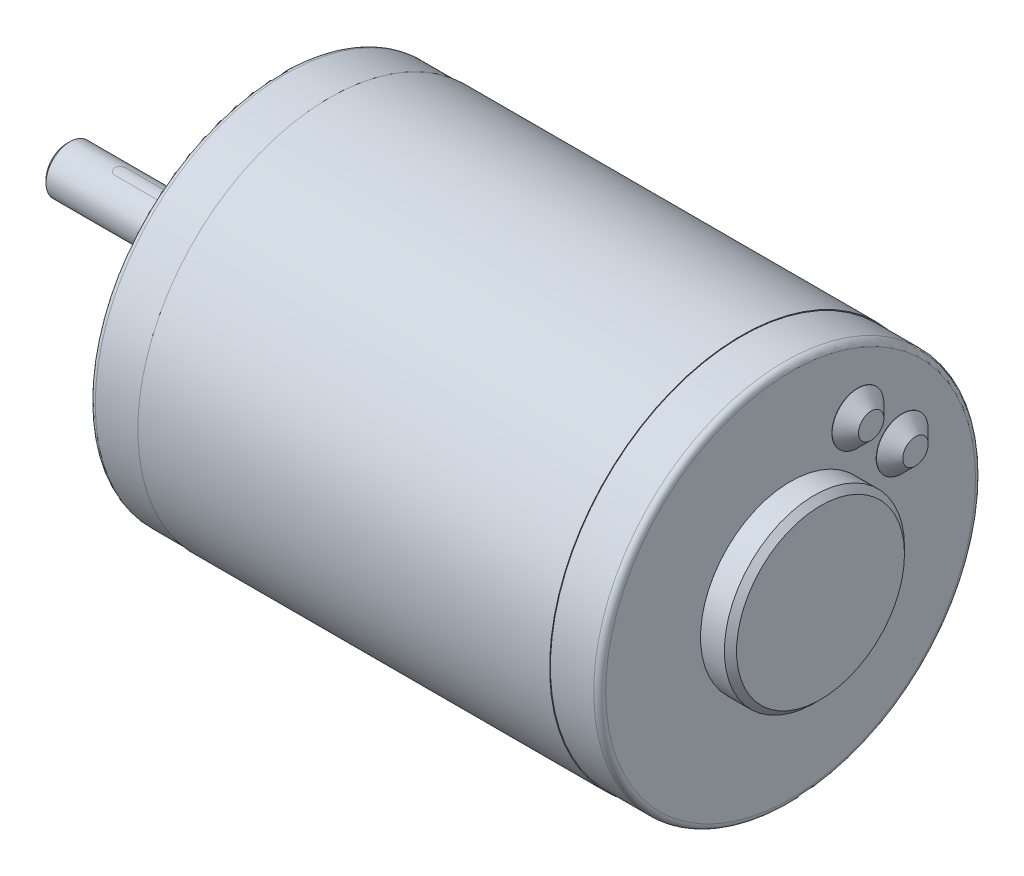
ISO-10303-21;
HEADER;
FILE_DESCRIPTION(('STEP AP214'),'2;1');
FILE_NAME('part.step','',(''),(''),'','','');
FILE_SCHEMA(('AUTOMOTIVE_DESIGN { 1 0 10303 214 1 1 1 1 }'));
ENDSEC;
DATA;
#1=APPLICATION_CONTEXT('core data for automotive mechanical design processes');
#2=APPLICATION_PROTOCOL_DEFINITION('international standard','automotive_design',2000,#1);
#3=PRODUCT_CONTEXT('',#1,'mechanical');
#4=PRODUCT('Part','Part','',(#3));
#5=PRODUCT_RELATED_PRODUCT_CATEGORY('part','',(#4));
#6=PRODUCT_DEFINITION_FORMATION('','',#4);
#7=PRODUCT_DEFINITION_CONTEXT('part definition',#1,'design');
#8=PRODUCT_DEFINITION('design','',#6,#7);
#9=PRODUCT_DEFINITION_SHAPE('','',#8);
#10=(LENGTH_UNIT() NAMED_UNIT(*) SI_UNIT(.MILLI.,.METRE.));
#11=(NAMED_UNIT(*) PLANE_ANGLE_UNIT() SI_UNIT($,.RADIAN.));
#12=(NAMED_UNIT(*) SI_UNIT($,.STERADIAN.) SOLID_ANGLE_UNIT());
#13=UNCERTAINTY_MEASURE_WITH_UNIT(LENGTH_MEASURE(1.E-05),#10,'distance_accuracy_value','');
#14=(GEOMETRIC_REPRESENTATION_CONTEXT(3) GLOBAL_UNCERTAINTY_ASSIGNED_CONTEXT((#13)) GLOBAL_UNIT_ASSIGNED_CONTEXT((#10,
#11,#12)) REPRESENTATION_CONTEXT('',''));
#15=CARTESIAN_POINT('',(0.,0.,0.));
#16=DIRECTION('',(0.,0.,1.));
#17=DIRECTION('',(1.,0.,0.));
#18=AXIS2_PLACEMENT_3D('',#15,#16,#17);
#19=CARTESIAN_POINT('',(-4.,0.,0.));
#20=DIRECTION('',(-1.,0.,0.));
#21=DIRECTION('',(0.,0.,1.));
#22=AXIS2_PLACEMENT_3D('',#19,#20,#21);
#23=PLANE('',#22);
#24=CARTESIAN_POINT('',(-4.,0.,0.));
#25=DIRECTION('',(-1.,0.,0.));
#26=DIRECTION('',(0.,0.,1.));
#27=AXIS2_PLACEMENT_3D('',#24,#25,#26);
#28=CIRCLE('',#27,8.50900000000003);
#29=CARTESIAN_POINT('',(-4.,0.,8.50900000000003));
#30=VERTEX_POINT('',#29);
#31=EDGE_CURVE('P0_E187',#30,#30,#28,.T.);
#32=ORIENTED_EDGE('',*,*,#31,.T.);
#33=EDGE_LOOP('',(#32));
#34=FACE_BOUND('',#33,.T.);
#35=CARTESIAN_POINT('',(-4.,0.,0.));
#36=DIRECTION('',(-1.,0.,0.));
#37=DIRECTION('',(0.,0.,1.));
#38=AXIS2_PLACEMENT_3D('',#35,#36,#37);
#39=CIRCLE('',#38,4.);
#40=CARTESIAN_POINT('',(-4.,0.,4.));
#41=VERTEX_POINT('',#40);
#42=EDGE_CURVE('P0_E119',#41,#41,#39,.T.);
#43=ORIENTED_EDGE('',*,*,#42,.F.);
#44=EDGE_LOOP('',(#43));
#45=FACE_BOUND('',#44,.T.);
#46=ADVANCED_FACE('P0_F36',(#34,#45),#23,.T.);
#47=CARTESIAN_POINT('',(0.,0.,0.));
#48=DIRECTION('',(-1.,0.,0.));
#49=DIRECTION('',(0.,0.,1.));
#50=AXIS2_PLACEMENT_3D('',#47,#48,#49);
#51=PLANE('',#50);
#52=CARTESIAN_POINT('',(0.,0.,0.));
#53=DIRECTION('',(-1.,0.,0.));
#54=DIRECTION('',(0.,0.,1.));
#55=AXIS2_PLACEMENT_3D('',#52,#53,#54);
#56=CIRCLE('',#55,30.877);
#57=CARTESIAN_POINT('',(0.,0.,30.877));
#58=VERTEX_POINT('',#57);
#59=EDGE_CURVE('P0_E205',#58,#58,#56,.T.);
#60=ORIENTED_EDGE('',*,*,#59,.T.);
#61=EDGE_LOOP('',(#60));
#62=FACE_BOUND('',#61,.T.);
#63=CARTESIAN_POINT('',(0.,25.4,0.));
#64=DIRECTION('',(-1.,0.,0.));
#65=DIRECTION('',(0.,0.,1.));
#66=AXIS2_PLACEMENT_3D('',#63,#64,#65);
#67=CIRCLE('',#66,2.01929999999999);
#68=CARTESIAN_POINT('',(0.,25.4,2.01929999999999));
#69=VERTEX_POINT('',#68);
#70=EDGE_CURVE('P0_E93',#69,#69,#67,.T.);
#71=ORIENTED_EDGE('',*,*,#70,.F.);
#72=EDGE_LOOP('',(#71));
#73=FACE_BOUND('',#72,.T.);
#74=CARTESIAN_POINT('',(0.,-25.4,0.));
#75=DIRECTION('',(-1.,0.,0.));
#76=DIRECTION('',(0.,0.,1.));
#77=AXIS2_PLACEMENT_3D('',#74,#75,#76);
#78=CIRCLE('',#77,2.01929999999999);
#79=CARTESIAN_POINT('',(0.,-25.4,2.01929999999999));
#80=VERTEX_POINT('',#79);
#81=EDGE_CURVE('P0_E92',#80,#80,#78,.T.);
#82=ORIENTED_EDGE('',*,*,#81,.F.);
#83=EDGE_LOOP('',(#82));
#84=FACE_BOUND('',#83,.T.);
#85=CARTESIAN_POINT('',(0.,0.,0.));
#86=DIRECTION('',(-1.,0.,0.));
#87=DIRECTION('',(0.,0.,1.));
#88=AXIS2_PLACEMENT_3D('',#85,#86,#87);
#89=CIRCLE('',#88,9.525);
#90=CARTESIAN_POINT('',(0.,0.,9.525));
#91=VERTEX_POINT('',#90);
#92=EDGE_CURVE('P0_E163',#91,#91,#89,.T.);
#93=ORIENTED_EDGE('',*,*,#92,.F.);
#94=EDGE_LOOP('',(#93));
#95=FACE_BOUND('',#94,.T.);
#96=ADVANCED_FACE('P0_F226',(#62,#73,#84,#95),#51,.T.);
#97=CARTESIAN_POINT('',(8.2296,32.004,0.));
#98=DIRECTION('',(-1.,0.,0.));
#99=DIRECTION('',(0.,0.,1.));
#100=AXIS2_PLACEMENT_3D('',#97,#98,#99);
#101=PLANE('',#100);
#102=CARTESIAN_POINT('',(8.2296,0.,0.));
#103=DIRECTION('',(1.,0.,0.));
#104=DIRECTION('',(0.,0.,-1.));
#105=AXIS2_PLACEMENT_3D('',#102,#103,#104);
#106=CIRCLE('',#105,32.004);
#107=CARTESIAN_POINT('',(8.2296,0.,-32.004));
#108=VERTEX_POINT('',#107);
#109=EDGE_CURVE('P0_E178',#108,#108,#106,.T.);
#110=ORIENTED_EDGE('',*,*,#109,.F.);
#111=EDGE_LOOP('',(#110));
#112=FACE_BOUND('',#111,.T.);
#113=CARTESIAN_POINT('',(8.2296,0.,0.));
#114=DIRECTION('',(-1.,0.,0.));
#115=DIRECTION('',(0.,0.,1.));
#116=AXIS2_PLACEMENT_3D('',#113,#114,#115);
#117=CIRCLE('',#116,31.877);
#118=CARTESIAN_POINT('',(8.2296,0.,31.877));
#119=VERTEX_POINT('',#118);
#120=EDGE_CURVE('P0_E166',#119,#119,#117,.T.);
#121=ORIENTED_EDGE('',*,*,#120,.F.);
#122=EDGE_LOOP('',(#121));
#123=FACE_BOUND('',#122,.T.);
#124=ADVANCED_FACE('P0_F232',(#112,#123),#101,.T.);
#125=CARTESIAN_POINT('',(85.216,0.,0.));
#126=DIRECTION('',(1.,0.,0.));
#127=DIRECTION('',(0.,0.,-1.));
#128=AXIS2_PLACEMENT_3D('',#125,#126,#127);
#129=PLANE('',#128);
#130=CARTESIAN_POINT('',(85.216,0.,0.));
#131=DIRECTION('',(1.,0.,0.));
#132=DIRECTION('',(0.,0.,-1.));
#133=AXIS2_PLACEMENT_3D('',#130,#131,#132);
#134=CIRCLE('',#133,30.877);
#135=CARTESIAN_POINT('',(85.216,0.,-30.877));
#136=VERTEX_POINT('',#135);
#137=EDGE_CURVE('P0_E44',#136,#136,#134,.T.);
#138=ORIENTED_EDGE('',*,*,#137,.T.);
#139=EDGE_LOOP('',(#138));
#140=FACE_BOUND('',#139,.T.);
#141=CARTESIAN_POINT('',(85.216,18.6070906828553,-11.2073596390943));
#142=DIRECTION('',(1.,0.,0.));
#143=DIRECTION('',(0.,0.,-1.));
#144=AXIS2_PLACEMENT_3D('',#141,#142,#143);
#145=CIRCLE('',#144,4.318);
#146=CARTESIAN_POINT('',(85.216,18.6070906828553,-15.5253596390943));
#147=VERTEX_POINT('',#146);
#148=EDGE_CURVE('P0_E184',#147,#147,#145,.T.);
#149=ORIENTED_EDGE('',*,*,#148,.F.);
#150=EDGE_LOOP('',(#149));
#151=FACE_BOUND('',#150,.T.);
#152=CARTESIAN_POINT('',(85.216,11.2073596390943,-18.6070906828553));
#153=DIRECTION('',(1.,0.,0.));
#154=DIRECTION('',(0.,0.,-1.));
#155=AXIS2_PLACEMENT_3D('',#152,#153,#154);
#156=CIRCLE('',#155,4.318);
#157=CARTESIAN_POINT('',(85.216,11.2073596390943,-22.9250906828553));
#158=VERTEX_POINT('',#157);
#159=EDGE_CURVE('P0_E181',#158,#158,#156,.T.);
#160=ORIENTED_EDGE('',*,*,#159,.F.);
#161=EDGE_LOOP('',(#160));
#162=FACE_BOUND('',#161,.T.);
#163=CARTESIAN_POINT('',(85.216,0.,0.));
#164=DIRECTION('',(1.,0.,0.));
#165=DIRECTION('',(0.,0.,-1.));
#166=AXIS2_PLACEMENT_3D('',#163,#164,#165);
#167=CIRCLE('',#166,15.0368);
#168=CARTESIAN_POINT('',(85.216,0.,-15.0368));
#169=VERTEX_POINT('',#168);
#170=EDGE_CURVE('P0_E169',#169,#169,#167,.T.);
#171=ORIENTED_EDGE('',*,*,#170,.F.);
#172=EDGE_LOOP('',(#171));
#173=FACE_BOUND('',#172,.T.);
#174=ADVANCED_FACE('P0_F213',(#140,#151,#162,#173),#129,.T.);
#175=CARTESIAN_POINT('',(76.9864,0.,0.));
#176=DIRECTION('',(1.,0.,0.));
#177=DIRECTION('',(0.,0.,-1.));
#178=AXIS2_PLACEMENT_3D('',#175,#176,#177);
#179=PLANE('',#178);
#180=CARTESIAN_POINT('',(76.9864,0.,0.));
#181=DIRECTION('',(1.,0.,0.));
#182=DIRECTION('',(0.,0.,-1.));
#183=AXIS2_PLACEMENT_3D('',#180,#181,#182);
#184=CIRCLE('',#183,32.004);
#185=CARTESIAN_POINT('',(76.9864,0.,-32.004));
#186=VERTEX_POINT('',#185);
#187=EDGE_CURVE('P0_E175',#186,#186,#184,.T.);
#188=ORIENTED_EDGE('',*,*,#187,.T.);
#189=EDGE_LOOP('',(#188));
#190=FACE_BOUND('',#189,.T.);
#191=CARTESIAN_POINT('',(76.9864,0.,0.));
#192=DIRECTION('',(1.,0.,0.));
#193=DIRECTION('',(0.,0.,-1.));
#194=AXIS2_PLACEMENT_3D('',#191,#192,#193);
#195=CIRCLE('',#194,31.877);
#196=CARTESIAN_POINT('',(76.9864,0.,-31.877));
#197=VERTEX_POINT('',#196);
#198=EDGE_CURVE('P0_E172',#197,#197,#195,.T.);
#199=ORIENTED_EDGE('',*,*,#198,.F.);
#200=EDGE_LOOP('',(#199));
#201=FACE_BOUND('',#200,.T.);
#202=ADVANCED_FACE('P0_F259',(#190,#201),#179,.T.);
#203=CARTESIAN_POINT('',(8.2296,0.,0.));
#204=DIRECTION('',(1.,0.,0.));
#205=DIRECTION('',(0.,0.,-1.));
#206=AXIS2_PLACEMENT_3D('',#203,#204,#205);
#207=CYLINDRICAL_SURFACE('',#206,32.004);
#208=ORIENTED_EDGE('',*,*,#109,.T.);
#209=EDGE_LOOP('',(#208));
#210=FACE_BOUND('',#209,.T.);
#211=ORIENTED_EDGE('',*,*,#187,.F.);
#212=EDGE_LOOP('',(#211));
#213=FACE_BOUND('',#212,.T.);
#214=ADVANCED_FACE('P0_F262',(#210,#213),#207,.T.);
#215=CARTESIAN_POINT('',(85.216,0.,0.));
#216=DIRECTION('',(-1.,0.,0.));
#217=DIRECTION('',(0.,0.,1.));
#218=AXIS2_PLACEMENT_3D('',#215,#216,#217);
#219=CYLINDRICAL_SURFACE('',#218,31.877);
#220=CARTESIAN_POINT('',(84.216,0.,0.));
#221=DIRECTION('',(1.,0.,0.));
#222=DIRECTION('',(0.,0.,-1.));
#223=AXIS2_PLACEMENT_3D('',#220,#221,#222);
#224=CIRCLE('',#223,31.877);
#225=CARTESIAN_POINT('',(84.216,0.,-31.877));
#226=VERTEX_POINT('',#225);
#227=EDGE_CURVE('P0_E11',#226,#226,#224,.F.);
#228=ORIENTED_EDGE('',*,*,#227,.T.);
#229=EDGE_LOOP('',(#228));
#230=FACE_BOUND('',#229,.T.);
#231=ORIENTED_EDGE('',*,*,#198,.T.);
#232=EDGE_LOOP('',(#231));
#233=FACE_BOUND('',#232,.T.);
#234=ADVANCED_FACE('P0_F255',(#230,#233),#219,.T.);
#235=CARTESIAN_POINT('',(90.216,0.,0.));
#236=DIRECTION('',(-1.,0.,0.));
#237=DIRECTION('',(0.,0.,1.));
#238=AXIS2_PLACEMENT_3D('',#235,#236,#237);
#239=CYLINDRICAL_SURFACE('',#238,15.0368);
#240=CARTESIAN_POINT('',(89.2,0.,0.));
#241=DIRECTION('',(1.,0.,0.));
#242=DIRECTION('',(0.,0.,-1.));
#243=AXIS2_PLACEMENT_3D('',#240,#241,#242);
#244=CIRCLE('',#243,15.0368);
#245=CARTESIAN_POINT('',(89.2,0.,-15.0368));
#246=VERTEX_POINT('',#245);
#247=EDGE_CURVE('P0_E196',#246,#246,#244,.F.);
#248=ORIENTED_EDGE('',*,*,#247,.T.);
#249=EDGE_LOOP('',(#248));
#250=FACE_BOUND('',#249,.T.);
#251=ORIENTED_EDGE('',*,*,#170,.T.);
#252=EDGE_LOOP('',(#251));
#253=FACE_BOUND('',#252,.T.);
#254=ADVANCED_FACE('P0_F251',(#250,#253),#239,.T.);
#255=CARTESIAN_POINT('',(90.216,0.,0.));
#256=DIRECTION('',(1.,0.,0.));
#257=DIRECTION('',(0.,0.,-1.));
#258=AXIS2_PLACEMENT_3D('',#255,#256,#257);
#259=PLANE('',#258);
#260=CARTESIAN_POINT('',(90.216,0.,0.));
#261=DIRECTION('',(1.,0.,0.));
#262=DIRECTION('',(0.,0.,-1.));
#263=AXIS2_PLACEMENT_3D('',#260,#261,#262);
#264=CIRCLE('',#263,14.0208);
#265=CARTESIAN_POINT('',(90.216,0.,-14.0208));
#266=VERTEX_POINT('',#265);
#267=EDGE_CURVE('P0_E193',#266,#266,#264,.T.);
#268=ORIENTED_EDGE('',*,*,#267,.T.);
#269=EDGE_LOOP('',(#268));
#270=FACE_BOUND('',#269,.T.);
#271=ADVANCED_FACE('P0_F247',(#270),#259,.T.);
#272=CARTESIAN_POINT('',(0.,0.,0.));
#273=DIRECTION('',(1.,0.,0.));
#274=DIRECTION('',(0.,0.,-1.));
#275=AXIS2_PLACEMENT_3D('',#272,#273,#274);
#276=CYLINDRICAL_SURFACE('',#275,31.877);
#277=CARTESIAN_POINT('',(0.999999999999997,0.,0.));
#278=DIRECTION('',(-1.,0.,0.));
#279=DIRECTION('',(0.,0.,1.));
#280=AXIS2_PLACEMENT_3D('',#277,#278,#279);
#281=CIRCLE('',#280,31.877);
#282=CARTESIAN_POINT('',(0.999999999999997,0.,31.877));
#283=VERTEX_POINT('',#282);
#284=EDGE_CURVE('P0_E208',#283,#283,#281,.F.);
#285=ORIENTED_EDGE('',*,*,#284,.T.);
#286=EDGE_LOOP('',(#285));
#287=FACE_BOUND('',#286,.T.);
#288=ORIENTED_EDGE('',*,*,#120,.T.);
#289=EDGE_LOOP('',(#288));
#290=FACE_BOUND('',#289,.T.);
#291=ADVANCED_FACE('P0_F242',(#287,#290),#276,.T.);
#292=CARTESIAN_POINT('',(-4.,0.,0.));
#293=DIRECTION('',(1.,0.,0.));
#294=DIRECTION('',(0.,0.,-1.));
#295=AXIS2_PLACEMENT_3D('',#292,#293,#294);
#296=CYLINDRICAL_SURFACE('',#295,9.525);
#297=CARTESIAN_POINT('',(-2.98400000000003,0.,0.));
#298=DIRECTION('',(-1.,0.,0.));
#299=DIRECTION('',(0.,0.,1.));
#300=AXIS2_PLACEMENT_3D('',#297,#298,#299);
#301=CIRCLE('',#300,9.525);
#302=CARTESIAN_POINT('',(-2.98400000000003,0.,9.525));
#303=VERTEX_POINT('',#302);
#304=EDGE_CURVE('P0_E190',#303,#303,#301,.F.);
#305=ORIENTED_EDGE('',*,*,#304,.T.);
#306=EDGE_LOOP('',(#305));
#307=FACE_BOUND('',#306,.T.);
#308=ORIENTED_EDGE('',*,*,#92,.T.);
#309=EDGE_LOOP('',(#308));
#310=FACE_BOUND('',#309,.T.);
#311=ADVANCED_FACE('P0_F240',(#307,#310),#296,.T.);
#312=CARTESIAN_POINT('',(-35.6,0.,0.));
#313=DIRECTION('',(1.,0.,0.));
#314=DIRECTION('',(0.,0.,-1.));
#315=AXIS2_PLACEMENT_3D('',#312,#313,#314);
#316=CYLINDRICAL_SURFACE('',#315,4.);
#317=CARTESIAN_POINT('',(-35.099999999993,0.,0.));
#318=DIRECTION('',(-1.,0.,0.));
#319=DIRECTION('',(0.,0.,1.));
#320=AXIS2_PLACEMENT_3D('',#317,#318,#319);
#321=CIRCLE('',#320,4.);
#322=CARTESIAN_POINT('',(-35.099999999993,0.,4.));
#323=VERTEX_POINT('',#322);
#324=EDGE_CURVE('P0_E202',#323,#323,#321,.F.);
#325=ORIENTED_EDGE('',*,*,#324,.T.);
#326=EDGE_LOOP('',(#325));
#327=FACE_BOUND('',#326,.T.);
#328=DIRECTION('',(1.,0.,0.));
#329=VECTOR('',#328,1.);
#330=CARTESIAN_POINT('',(0.,3.87298334620741,-1.));
#331=LINE('',#330,#329);
#332=CARTESIAN_POINT('',(-26.6,3.87298334620741,-1.));
#333=VERTEX_POINT('',#332);
#334=CARTESIAN_POINT('',(-7.1,3.87298334620741,-1.));
#335=VERTEX_POINT('',#334);
#336=EDGE_CURVE('P0_E138',#333,#335,#331,.T.);
#337=ORIENTED_EDGE('',*,*,#336,.T.);
#338=CARTESIAN_POINT('',(-7.1,3.87298334620741,-1.));
#339=CARTESIAN_POINT('',(-7.07233701489346,3.87298148580177,-1.00000033749611));
#340=CARTESIAN_POINT('',(-7.04468773698177,3.8732800994947,-0.998851407375366));
#341=CARTESIAN_POINT('',(-6.98959596469644,3.87445904774558,-0.994271295395754));
#342=CARTESIAN_POINT('',(-6.96215343631291,3.87533928441687,-0.990840497572679));
#343=CARTESIAN_POINT('',(-6.88054682679116,3.87881710972053,-0.977175239382526));
#344=CARTESIAN_POINT('',(-6.82694353151779,3.88225203148808,-0.963567695172493));
#345=CARTESIAN_POINT('',(-6.72287532621804,3.89095422588002,-0.927798076247997));
#346=CARTESIAN_POINT('',(-6.67241012178714,3.89622132630929,-0.905636805423836));
#347=CARTESIAN_POINT('',(-6.57588855135267,3.90799134471939,-0.853415378025865));
#348=CARTESIAN_POINT('',(-6.52983337210904,3.91449459395647,-0.823353103356933));
#349=CARTESIAN_POINT('',(-6.4424561180939,3.92816262398025,-0.755484471828069));
#350=CARTESIAN_POINT('',(-6.40124511375448,3.93533791028915,-0.717537268783976));
#351=CARTESIAN_POINT('',(-6.32569791051729,3.94945104396193,-0.63527578051623));
#352=CARTESIAN_POINT('',(-6.29136281053206,3.95638885322537,-0.590960479478831));
#353=CARTESIAN_POINT('',(-6.23008899838136,3.96936182283248,-0.496456899401691));
#354=CARTESIAN_POINT('',(-6.20326010401603,3.9753830468173,-0.446195340334474));
#355=CARTESIAN_POINT('',(-6.1584752658033,3.98572346250588,-0.341702590842919));
#356=CARTESIAN_POINT('',(-6.14051757570017,3.990042989147,-0.28747218408301));
#357=CARTESIAN_POINT('',(-6.11434100722257,3.99641900005128,-0.17774410852516));
#358=CARTESIAN_POINT('',(-6.10593232757718,3.998519529013,-0.122294322002858));
#359=CARTESIAN_POINT('',(-6.09849662845671,4.00037438150815,-0.0107327756816796));
#360=CARTESIAN_POINT('',(-6.09946842980766,4.00012899993444,0.0453789000287057));
#361=CARTESIAN_POINT('',(-6.11062996368545,3.99735237365735,0.155352492972096));
#362=CARTESIAN_POINT('',(-6.12061461659948,3.9948719867736,0.209236701739855));
#363=CARTESIAN_POINT('',(-6.14918867918275,3.98796330636495,0.31453871108434));
#364=CARTESIAN_POINT('',(-6.16777846956858,3.98353492665556,0.365956402423988));
#365=CARTESIAN_POINT('',(-6.21320128067065,3.97314997761798,0.465407286024539));
#366=CARTESIAN_POINT('',(-6.24010739423284,3.96717993827555,0.513405629602248));
#367=CARTESIAN_POINT('',(-6.30134312983347,3.95435945541919,0.604276631230014));
#368=CARTESIAN_POINT('',(-6.33567387025322,3.94750887933198,0.647148515562289));
#369=CARTESIAN_POINT('',(-6.41187891208131,3.93345566022865,0.72776938970849));
#370=CARTESIAN_POINT('',(-6.45393163653981,3.92624850477685,0.765349103054127));
#371=CARTESIAN_POINT('',(-6.54382986692773,3.91246168284006,0.832969575186237));
#372=CARTESIAN_POINT('',(-6.59167695328356,3.90588218842993,0.863008270245062));
#373=CARTESIAN_POINT('',(-6.69214559782377,3.89407813586325,0.914804709285962));
#374=CARTESIAN_POINT('',(-6.74479146489609,3.88886106009136,0.936517017887269));
#375=CARTESIAN_POINT('',(-6.85311692841829,3.88047058807055,0.970702351849829));
#376=CARTESIAN_POINT('',(-6.90879185514984,3.87729413761435,0.983189189212132));
#377=CARTESIAN_POINT('',(-6.9874573807589,3.87455290681524,0.993904635150938));
#378=CARTESIAN_POINT('',(-7.00991970321318,3.87396523110859,0.996190790966708));
#379=CARTESIAN_POINT('',(-7.05491778990932,3.87318062488974,0.999236757697394));
#380=CARTESIAN_POINT('',(-7.07745337595529,3.87298306219461,0.999999038096045));
#381=CARTESIAN_POINT('',(-7.1,3.87298334620741,1.));
#382=B_SPLINE_CURVE_WITH_KNOTS('',3,(#338,#339,#340,#341,#342,#343,#344,#345,#346,#347,#348,
#349,#350,#351,#352,#353,#354,#355,#356,#357,#358,#359,#360,#361,#362,#363,#364,#365,#366,#367,
#368,#369,#370,#371,#372,#373,#374,#375,#376,#377,#378,#379,#380,#381),.UNSPECIFIED.,.F.,.F.,(4,
2,2,2,2,2,2,2,2,2,2,2,2,2,2,2,2,2,2,2,2,4),(0.,0.0829365303397693,0.165859106084651,
0.331229963080317,0.496585282091498,0.661984974726749,0.830641897427974,0.999325753539193,
1.17036187098235,1.34136430732424,1.50890481515325,1.67642426256639,1.84022545479276,
2.00403389475838,2.16932509450376,2.33464120964329,2.50441429534542,2.67423379180967,
2.84496720161068,3.01544447539986,3.08315848722648,3.15076267731671),.UNSPECIFIED.);
#383=CARTESIAN_POINT('',(-7.1,3.87298334620741,1.));
#384=VERTEX_POINT('',#383);
#385=EDGE_CURVE('P0_E115',#335,#384,#382,.T.);
#386=ORIENTED_EDGE('',*,*,#385,.T.);
#387=DIRECTION('',(1.,0.,0.));
#388=VECTOR('',#387,1.);
#389=CARTESIAN_POINT('',(0.,3.87298334620741,1.));
#390=LINE('',#389,#388);
#391=CARTESIAN_POINT('',(-26.6,3.87298334620741,1.));
#392=VERTEX_POINT('',#391);
#393=EDGE_CURVE('P0_E153',#384,#392,#390,.F.);
#394=ORIENTED_EDGE('',*,*,#393,.T.);
#395=CARTESIAN_POINT('',(-26.6,3.87298334620741,1.));
#396=CARTESIAN_POINT('',(-26.6276629851065,3.87298148580177,1.00000033749611));
#397=CARTESIAN_POINT('',(-26.6553122630182,3.8732800994947,0.998851407375366));
#398=CARTESIAN_POINT('',(-26.7104040353036,3.87445904774558,0.994271295395754));
#399=CARTESIAN_POINT('',(-26.7378465636871,3.87533928441687,0.990840497572679));
#400=CARTESIAN_POINT('',(-26.8194531732088,3.87881710972053,0.977175239382526));
#401=CARTESIAN_POINT('',(-26.8730564684822,3.88225203148808,0.963567695172493));
#402=CARTESIAN_POINT('',(-26.977124673782,3.89095422588002,0.927798076247996));
#403=CARTESIAN_POINT('',(-27.0275898782129,3.89622132630929,0.905636805423835));
#404=CARTESIAN_POINT('',(-27.1241114486473,3.90799134471939,0.853415378025864));
#405=CARTESIAN_POINT('',(-27.170166627891,3.91449459395647,0.823353103356932));
#406=CARTESIAN_POINT('',(-27.2575438819061,3.92816262398025,0.755484471828069));
#407=CARTESIAN_POINT('',(-27.2987548862455,3.93533791028915,0.717537268783975));
#408=CARTESIAN_POINT('',(-27.3743020894827,3.94945104396193,0.635275780516229));
#409=CARTESIAN_POINT('',(-27.4086371894679,3.95638885322537,0.59096047947883));
#410=CARTESIAN_POINT('',(-27.4699110016186,3.96936182283248,0.496456899401689));
#411=CARTESIAN_POINT('',(-27.496739895984,3.9753830468173,0.446195340334472));
#412=CARTESIAN_POINT('',(-27.5415247341967,3.98572346250588,0.341702590842916));
#413=CARTESIAN_POINT('',(-27.5594824242998,3.990042989147,0.287472184083007));
#414=CARTESIAN_POINT('',(-27.5856589927774,3.99641900005128,0.177744108525158));
#415=CARTESIAN_POINT('',(-27.5940676724228,3.998519529013,0.122294322002856));
#416=CARTESIAN_POINT('',(-27.6015033715433,4.00037438150815,0.0107327756816781));
#417=CARTESIAN_POINT('',(-27.6005315701923,4.00012899993444,-0.0453789000287067));
#418=CARTESIAN_POINT('',(-27.5893700363146,3.99735237365735,-0.155352492972096));
#419=CARTESIAN_POINT('',(-27.5793853834005,3.9948719867736,-0.209236701739855));
#420=CARTESIAN_POINT('',(-27.5508113208173,3.98796330636495,-0.31453871108434));
#421=CARTESIAN_POINT('',(-27.5322215304314,3.98353492665556,-0.365956402423988));
#422=CARTESIAN_POINT('',(-27.4867987193294,3.97314997761798,-0.46540728602454));
#423=CARTESIAN_POINT('',(-27.4598926057672,3.96717993827555,-0.513405629602248));
#424=CARTESIAN_POINT('',(-27.3986568701665,3.95435945541919,-0.604276631230015));
#425=CARTESIAN_POINT('',(-27.3643261297468,3.94750887933198,-0.64714851556229));
#426=CARTESIAN_POINT('',(-27.2881210879187,3.93345566022865,-0.727769389708492));
#427=CARTESIAN_POINT('',(-27.2460683634602,3.92624850477685,-0.765349103054128));
#428=CARTESIAN_POINT('',(-27.1561701330723,3.91246168284006,-0.832969575186237));
#429=CARTESIAN_POINT('',(-27.1083230467164,3.90588218842993,-0.863008270245062));
#430=CARTESIAN_POINT('',(-27.0078544021762,3.89407813586325,-0.914804709285961));
#431=CARTESIAN_POINT('',(-26.9552085351039,3.88886106009136,-0.936517017887269));
#432=CARTESIAN_POINT('',(-26.8468830715817,3.88047058807054,-0.970702351849828));
#433=CARTESIAN_POINT('',(-26.7912081448502,3.87729413761435,-0.983189189212131));
#434=CARTESIAN_POINT('',(-26.7125426192411,3.87455290681524,-0.993904635150938));
#435=CARTESIAN_POINT('',(-26.6900802967868,3.87396523110859,-0.996190790966708));
#436=CARTESIAN_POINT('',(-26.6450822100907,3.87318062488974,-0.999236757697394));
#437=CARTESIAN_POINT('',(-26.6225466240447,3.87298306219461,-0.999999038096045));
#438=CARTESIAN_POINT('',(-26.6,3.87298334620741,-1.));
#439=B_SPLINE_CURVE_WITH_KNOTS('',3,(#395,#396,#397,#398,#399,#400,#401,#402,#403,#404,#405,
#406,#407,#408,#409,#410,#411,#412,#413,#414,#415,#416,#417,#418,#419,#420,#421,#422,#423,#424,
#425,#426,#427,#428,#429,#430,#431,#432,#433,#434,#435,#436,#437,#438),.UNSPECIFIED.,.F.,.F.,(4,
2,2,2,2,2,2,2,2,2,2,2,2,2,2,2,2,2,2,2,2,4),(0.,0.0829365303397727,0.165859106084653,
0.331229963080318,0.496585282091499,0.661984974726751,0.830641897427976,0.999325753539196,
1.17036187098235,1.34136430732425,1.50890481515325,1.67642426256639,1.84022545479276,
2.00403389475838,2.16932509450376,2.33464120964329,2.50441429534542,2.67423379180967,
2.84496720161068,3.01544447539986,3.08315848722649,3.15076267731671),.UNSPECIFIED.);
#440=EDGE_CURVE('P0_E51',#392,#333,#439,.T.);
#441=ORIENTED_EDGE('',*,*,#440,.T.);
#442=EDGE_LOOP('',(#337,#386,#394,#441));
#443=FACE_BOUND('',#442,.T.);
#444=ORIENTED_EDGE('',*,*,#42,.T.);
#445=EDGE_LOOP('',(#444));
#446=FACE_BOUND('',#445,.T.);
#447=ADVANCED_FACE('P0_F238',(#327,#443,#446),#316,.T.);
#448=CARTESIAN_POINT('',(-35.6,0.,0.));
#449=DIRECTION('',(-1.,0.,0.));
#450=DIRECTION('',(0.,0.,1.));
#451=AXIS2_PLACEMENT_3D('',#448,#449,#450);
#452=PLANE('',#451);
#453=CARTESIAN_POINT('',(-35.6,0.,0.));
#454=DIRECTION('',(-1.,0.,0.));
#455=DIRECTION('',(0.,0.,1.));
#456=AXIS2_PLACEMENT_3D('',#453,#454,#455);
#457=CIRCLE('',#456,3.49999999993612);
#458=CARTESIAN_POINT('',(-35.6,0.,3.49999999993612));
#459=VERTEX_POINT('',#458);
#460=EDGE_CURVE('P0_E199',#459,#459,#457,.T.);
#461=ORIENTED_EDGE('',*,*,#460,.T.);
#462=EDGE_LOOP('',(#461));
#463=FACE_BOUND('',#462,.T.);
#464=ADVANCED_FACE('P0_F289',(#463),#452,.T.);
#465=CARTESIAN_POINT('',(-7.1,32.005,0.));
#466=DIRECTION('',(0.,-1.,0.));
#467=DIRECTION('',(0.,0.,-1.));
#468=AXIS2_PLACEMENT_3D('',#465,#466,#467);
#469=CYLINDRICAL_SURFACE('',#468,1.);
#470=ORIENTED_EDGE('',*,*,#385,.F.);
#471=DIRECTION('',(0.,-1.,0.));
#472=VECTOR('',#471,1.);
#473=CARTESIAN_POINT('',(-7.1,32.005,-1.));
#474=LINE('',#473,#472);
#475=CARTESIAN_POINT('',(-7.1,2.79999999999999,-1.));
#476=VERTEX_POINT('',#475);
#477=EDGE_CURVE('P0_E137',#335,#476,#474,.T.);
#478=ORIENTED_EDGE('',*,*,#477,.T.);
#479=CARTESIAN_POINT('',(-7.1,2.79999999999999,0.));
#480=DIRECTION('',(0.,-1.,0.));
#481=DIRECTION('',(0.,0.,-1.));
#482=AXIS2_PLACEMENT_3D('',#479,#480,#481);
#483=CIRCLE('',#482,1.);
#484=CARTESIAN_POINT('',(-7.1,2.79999999999999,1.));
#485=VERTEX_POINT('',#484);
#486=EDGE_CURVE('P0_E126',#476,#485,#483,.T.);
#487=ORIENTED_EDGE('',*,*,#486,.T.);
#488=DIRECTION('',(0.,-1.,0.));
#489=VECTOR('',#488,1.);
#490=CARTESIAN_POINT('',(-7.1,32.005,1.));
#491=LINE('',#490,#489);
#492=EDGE_CURVE('P0_E59',#384,#485,#491,.T.);
#493=ORIENTED_EDGE('',*,*,#492,.F.);
#494=EDGE_LOOP('',(#470,#478,#487,#493));
#495=FACE_BOUND('',#494,.T.);
#496=ADVANCED_FACE('P0_F291',(#495),#469,.F.);
#497=CARTESIAN_POINT('',(-26.6,32.005,-1.));
#498=DIRECTION('',(0.,0.,-1.));
#499=DIRECTION('',(-1.,0.,0.));
#500=AXIS2_PLACEMENT_3D('',#497,#498,#499);
#501=PLANE('',#500);
#502=ORIENTED_EDGE('',*,*,#336,.F.);
#503=DIRECTION('',(0.,-1.,0.));
#504=VECTOR('',#503,1.);
#505=CARTESIAN_POINT('',(-26.6,32.005,-1.));
#506=LINE('',#505,#504);
#507=CARTESIAN_POINT('',(-26.6,2.79999999999999,-1.));
#508=VERTEX_POINT('',#507);
#509=EDGE_CURVE('P0_E136',#333,#508,#506,.T.);
#510=ORIENTED_EDGE('',*,*,#509,.T.);
#511=DIRECTION('',(1.,0.,0.));
#512=VECTOR('',#511,1.);
#513=CARTESIAN_POINT('',(-26.6,2.79999999999999,-1.));
#514=LINE('',#513,#512);
#515=EDGE_CURVE('P0_E116',#508,#476,#514,.T.);
#516=ORIENTED_EDGE('',*,*,#515,.T.);
#517=ORIENTED_EDGE('',*,*,#477,.F.);
#518=EDGE_LOOP('',(#502,#510,#516,#517));
#519=FACE_BOUND('',#518,.T.);
#520=ADVANCED_FACE('P0_F296',(#519),#501,.F.);
#521=CARTESIAN_POINT('',(-26.6,32.005,0.));
#522=DIRECTION('',(0.,-1.,0.));
#523=DIRECTION('',(0.,0.,-1.));
#524=AXIS2_PLACEMENT_3D('',#521,#522,#523);
#525=CYLINDRICAL_SURFACE('',#524,1.);
#526=ORIENTED_EDGE('',*,*,#440,.F.);
#527=DIRECTION('',(0.,-1.,0.));
#528=VECTOR('',#527,1.);
#529=CARTESIAN_POINT('',(-26.6,32.005,1.));
#530=LINE('',#529,#528);
#531=CARTESIAN_POINT('',(-26.6,2.79999999999999,1.));
#532=VERTEX_POINT('',#531);
#533=EDGE_CURVE('P0_E128',#392,#532,#530,.T.);
#534=ORIENTED_EDGE('',*,*,#533,.T.);
#535=CARTESIAN_POINT('',(-26.6,2.79999999999999,0.));
#536=DIRECTION('',(0.,-1.,0.));
#537=DIRECTION('',(0.,0.,-1.));
#538=AXIS2_PLACEMENT_3D('',#535,#536,#537);
#539=CIRCLE('',#538,1.);
#540=EDGE_CURVE('P0_E120',#532,#508,#539,.T.);
#541=ORIENTED_EDGE('',*,*,#540,.T.);
#542=ORIENTED_EDGE('',*,*,#509,.F.);
#543=EDGE_LOOP('',(#526,#534,#541,#542));
#544=FACE_BOUND('',#543,.T.);
#545=ADVANCED_FACE('P0_F302',(#544),#525,.F.);
#546=CARTESIAN_POINT('',(-7.1,32.005,1.));
#547=DIRECTION('',(0.,0.,1.));
#548=DIRECTION('',(1.,0.,0.));
#549=AXIS2_PLACEMENT_3D('',#546,#547,#548);
#550=PLANE('',#549);
#551=ORIENTED_EDGE('',*,*,#393,.F.);
#552=ORIENTED_EDGE('',*,*,#492,.T.);
#553=DIRECTION('',(-1.,0.,0.));
#554=VECTOR('',#553,1.);
#555=CARTESIAN_POINT('',(-7.1,2.79999999999999,1.));
#556=LINE('',#555,#554);
#557=EDGE_CURVE('P0_E123',#485,#532,#556,.T.);
#558=ORIENTED_EDGE('',*,*,#557,.T.);
#559=ORIENTED_EDGE('',*,*,#533,.F.);
#560=EDGE_LOOP('',(#551,#552,#558,#559));
#561=FACE_BOUND('',#560,.T.);
#562=ADVANCED_FACE('P0_F305',(#561),#550,.F.);
#563=CARTESIAN_POINT('',(-7.1,2.79999999999999,0.));
#564=DIRECTION('',(0.,-1.,0.));
#565=DIRECTION('',(0.,0.,-1.));
#566=AXIS2_PLACEMENT_3D('',#563,#564,#565);
#567=PLANE('',#566);
#568=ORIENTED_EDGE('',*,*,#486,.F.);
#569=ORIENTED_EDGE('',*,*,#515,.F.);
#570=ORIENTED_EDGE('',*,*,#540,.F.);
#571=ORIENTED_EDGE('',*,*,#557,.F.);
#572=EDGE_LOOP('',(#568,#569,#570,#571));
#573=FACE_BOUND('',#572,.T.);
#574=ADVANCED_FACE('P0_F307',(#573),#567,.F.);
#575=CARTESIAN_POINT('',(85.216,11.2073596390943,-18.6070906828553));
#576=DIRECTION('',(1.,0.,0.));
#577=DIRECTION('',(0.,0.,-1.));
#578=AXIS2_PLACEMENT_3D('',#575,#576,#577);
#579=CYLINDRICAL_SURFACE('',#578,4.318);
#580=ORIENTED_EDGE('',*,*,#159,.T.);
#581=EDGE_LOOP('',(#580));
#582=FACE_BOUND('',#581,.T.);
#583=CARTESIAN_POINT('',(85.2639,11.2073596390943,-18.6070906828553));
#584=DIRECTION('',(1.,0.,0.));
#585=DIRECTION('',(0.,0.,-1.));
#586=AXIS2_PLACEMENT_3D('',#583,#584,#585);
#587=CIRCLE('',#586,4.318);
#588=CARTESIAN_POINT('',(85.2639,11.2073596390943,-22.9250906828553));
#589=VERTEX_POINT('',#588);
#590=EDGE_CURVE('P0_E109',#589,#589,#587,.T.);
#591=ORIENTED_EDGE('',*,*,#590,.F.);
#592=EDGE_LOOP('',(#591));
#593=FACE_BOUND('',#592,.T.);
#594=ADVANCED_FACE('P0_F312',(#582,#593),#579,.T.);
#595=CARTESIAN_POINT('',(87.4638999999649,11.2073596390943,-18.6070906828553));
#596=DIRECTION('',(1.,0.,0.));
#597=DIRECTION('',(0.,0.,-1.));
#598=AXIS2_PLACEMENT_3D('',#595,#596,#597);
#599=PLANE('',#598);
#600=CARTESIAN_POINT('',(87.4638999999649,11.2073596390943,-18.6070906828553));
#601=DIRECTION('',(1.,0.,0.));
#602=DIRECTION('',(0.,0.,-1.));
#603=AXIS2_PLACEMENT_3D('',#600,#601,#602);
#604=CIRCLE('',#603,2.11800000003506);
#605=CARTESIAN_POINT('',(87.4638999999649,11.2073596390943,-20.7250906828904));
#606=VERTEX_POINT('',#605);
#607=EDGE_CURVE('P0_E112',#606,#606,#604,.T.);
#608=ORIENTED_EDGE('',*,*,#607,.T.);
#609=EDGE_LOOP('',(#608));
#610=FACE_BOUND('',#609,.T.);
#611=ADVANCED_FACE('P0_F335',(#610),#599,.T.);
#612=CARTESIAN_POINT('',(87.4638999999649,11.2073596390943,-18.6070906828553));
#613=DIRECTION('',(-1.,0.,0.));
#614=DIRECTION('',(0.,0.,1.));
#615=AXIS2_PLACEMENT_3D('',#612,#613,#614);
#616=CONICAL_SURFACE('',#615,2.11800000003506,0.78539816339745);
#617=ORIENTED_EDGE('',*,*,#590,.T.);
#618=EDGE_LOOP('',(#617));
#619=FACE_BOUND('',#618,.T.);
#620=ORIENTED_EDGE('',*,*,#607,.F.);
#621=EDGE_LOOP('',(#620));
#622=FACE_BOUND('',#621,.T.);
#623=ADVANCED_FACE('P0_F341',(#619,#622),#616,.T.);
#624=CARTESIAN_POINT('',(85.216,18.6070906828553,-11.2073596390943));
#625=DIRECTION('',(1.,0.,0.));
#626=DIRECTION('',(0.,0.,-1.));
#627=AXIS2_PLACEMENT_3D('',#624,#625,#626);
#628=CYLINDRICAL_SURFACE('',#627,4.318);
#629=ORIENTED_EDGE('',*,*,#148,.T.);
#630=EDGE_LOOP('',(#629));
#631=FACE_BOUND('',#630,.T.);
#632=CARTESIAN_POINT('',(85.2639,18.6070906828553,-11.2073596390943));
#633=DIRECTION('',(1.,0.,0.));
#634=DIRECTION('',(0.,0.,-1.));
#635=AXIS2_PLACEMENT_3D('',#632,#633,#634);
#636=CIRCLE('',#635,4.318);
#637=CARTESIAN_POINT('',(85.2639,18.6070906828553,-15.5253596390943));
#638=VERTEX_POINT('',#637);
#639=EDGE_CURVE('P0_E103',#638,#638,#636,.T.);
#640=ORIENTED_EDGE('',*,*,#639,.F.);
#641=EDGE_LOOP('',(#640));
#642=FACE_BOUND('',#641,.T.);
#643=ADVANCED_FACE('P0_F345',(#631,#642),#628,.T.);
#644=CARTESIAN_POINT('',(87.4638999999503,18.6070906828553,-11.2073596390943));
#645=DIRECTION('',(1.,0.,0.));
#646=DIRECTION('',(0.,0.,-1.));
#647=AXIS2_PLACEMENT_3D('',#644,#645,#646);
#648=PLANE('',#647);
#649=CARTESIAN_POINT('',(87.4638999999503,18.6070906828553,-11.2073596390943));
#650=DIRECTION('',(1.,0.,0.));
#651=DIRECTION('',(0.,0.,-1.));
#652=AXIS2_PLACEMENT_3D('',#649,#650,#651);
#653=CIRCLE('',#652,2.11800000004973);
#654=CARTESIAN_POINT('',(87.4638999999503,18.6070906828553,-13.3253596391441));
#655=VERTEX_POINT('',#654);
#656=EDGE_CURVE('P0_E106',#655,#655,#653,.T.);
#657=ORIENTED_EDGE('',*,*,#656,.T.);
#658=EDGE_LOOP('',(#657));
#659=FACE_BOUND('',#658,.T.);
#660=ADVANCED_FACE('P0_F349',(#659),#648,.T.);
#661=CARTESIAN_POINT('',(87.4638999999503,18.6070906828553,-11.2073596390943));
#662=DIRECTION('',(-1.,0.,0.));
#663=DIRECTION('',(0.,0.,1.));
#664=AXIS2_PLACEMENT_3D('',#661,#662,#663);
#665=CONICAL_SURFACE('',#664,2.11800000004973,0.785398163397447);
#666=ORIENTED_EDGE('',*,*,#639,.T.);
#667=EDGE_LOOP('',(#666));
#668=FACE_BOUND('',#667,.T.);
#669=ORIENTED_EDGE('',*,*,#656,.F.);
#670=EDGE_LOOP('',(#669));
#671=FACE_BOUND('',#670,.T.);
#672=ADVANCED_FACE('P0_F353',(#668,#671),#665,.T.);
#673=CARTESIAN_POINT('',(13.6144,-25.4,0.));
#674=DIRECTION('',(-1.,0.,0.));
#675=DIRECTION('',(0.,0.,1.));
#676=AXIS2_PLACEMENT_3D('',#673,#674,#675);
#677=CONICAL_SURFACE('',#676,2.01929999999999,1.02974425867198);
#678=CARTESIAN_POINT('',(14.8277178480152,-25.4,0.));
#679=VERTEX_POINT('',#678);
#680=VERTEX_LOOP('',#679);
#681=FACE_BOUND('',#680,.T.);
#682=CARTESIAN_POINT('',(13.6144,-25.4,0.));
#683=DIRECTION('',(-1.,0.,0.));
#684=DIRECTION('',(0.,0.,1.));
#685=AXIS2_PLACEMENT_3D('',#682,#683,#684);
#686=CIRCLE('',#685,2.01929999999999);
#687=CARTESIAN_POINT('',(13.6144,-25.4,2.01929999999999));
#688=VERTEX_POINT('',#687);
#689=EDGE_CURVE('P0_E96',#688,#688,#686,.T.);
#690=ORIENTED_EDGE('',*,*,#689,.T.);
#691=EDGE_LOOP('',(#690));
#692=FACE_BOUND('',#691,.T.);
#693=ADVANCED_FACE('P0_F357',(#681,#692),#677,.F.);
#694=CARTESIAN_POINT('',(0.,-25.4,0.));
#695=DIRECTION('',(-1.,0.,0.));
#696=DIRECTION('',(0.,0.,1.));
#697=AXIS2_PLACEMENT_3D('',#694,#695,#696);
#698=CYLINDRICAL_SURFACE('',#697,2.01929999999999);
#699=ORIENTED_EDGE('',*,*,#689,.F.);
#700=EDGE_LOOP('',(#699));
#701=FACE_BOUND('',#700,.T.);
#702=ORIENTED_EDGE('',*,*,#81,.T.);
#703=EDGE_LOOP('',(#702));
#704=FACE_BOUND('',#703,.T.);
#705=ADVANCED_FACE('P0_F86',(#701,#704),#698,.F.);
#706=CARTESIAN_POINT('',(13.6144,25.4,0.));
#707=DIRECTION('',(-1.,0.,0.));
#708=DIRECTION('',(0.,0.,1.));
#709=AXIS2_PLACEMENT_3D('',#706,#707,#708);
#710=CONICAL_SURFACE('',#709,2.01929999999999,1.02974425867198);
#711=CARTESIAN_POINT('',(14.8277178480152,25.4,0.));
#712=VERTEX_POINT('',#711);
#713=VERTEX_LOOP('',#712);
#714=FACE_BOUND('',#713,.T.);
#715=CARTESIAN_POINT('',(13.6144,25.4,0.));
#716=DIRECTION('',(-1.,0.,0.));
#717=DIRECTION('',(0.,0.,1.));
#718=AXIS2_PLACEMENT_3D('',#715,#716,#717);
#719=CIRCLE('',#718,2.01929999999999);
#720=CARTESIAN_POINT('',(13.6144,25.4,2.01929999999999));
#721=VERTEX_POINT('',#720);
#722=EDGE_CURVE('P0_E90',#721,#721,#719,.T.);
#723=ORIENTED_EDGE('',*,*,#722,.T.);
#724=EDGE_LOOP('',(#723));
#725=FACE_BOUND('',#724,.T.);
#726=ADVANCED_FACE('P0_F82',(#714,#725),#710,.F.);
#727=CARTESIAN_POINT('',(0.,25.4,0.));
#728=DIRECTION('',(-1.,0.,0.));
#729=DIRECTION('',(0.,0.,1.));
#730=AXIS2_PLACEMENT_3D('',#727,#728,#729);
#731=CYLINDRICAL_SURFACE('',#730,2.01929999999999);
#732=ORIENTED_EDGE('',*,*,#722,.F.);
#733=EDGE_LOOP('',(#732));
#734=FACE_BOUND('',#733,.T.);
#735=ORIENTED_EDGE('',*,*,#70,.T.);
#736=EDGE_LOOP('',(#735));
#737=FACE_BOUND('',#736,.T.);
#738=ADVANCED_FACE('P0_F85',(#734,#737),#731,.F.);
#739=CARTESIAN_POINT('',(-4.,0.,0.));
#740=DIRECTION('',(1.,0.,0.));
#741=DIRECTION('',(0.,0.,-1.));
#742=AXIS2_PLACEMENT_3D('',#739,#740,#741);
#743=CONICAL_SURFACE('',#742,8.50900000000003,0.785398163397447);
#744=ORIENTED_EDGE('',*,*,#304,.F.);
#745=EDGE_LOOP('',(#744));
#746=FACE_BOUND('',#745,.T.);
#747=ORIENTED_EDGE('',*,*,#31,.F.);
#748=EDGE_LOOP('',(#747));
#749=FACE_BOUND('',#748,.T.);
#750=ADVANCED_FACE('P0_F273',(#746,#749),#743,.T.);
#751=CARTESIAN_POINT('',(90.216,0.,0.));
#752=DIRECTION('',(-1.,0.,0.));
#753=DIRECTION('',(0.,0.,1.));
#754=AXIS2_PLACEMENT_3D('',#751,#752,#753);
#755=CONICAL_SURFACE('',#754,14.0208,0.785398163397447);
#756=ORIENTED_EDGE('',*,*,#247,.F.);
#757=EDGE_LOOP('',(#756));
#758=FACE_BOUND('',#757,.T.);
#759=ORIENTED_EDGE('',*,*,#267,.F.);
#760=EDGE_LOOP('',(#759));
#761=FACE_BOUND('',#760,.T.);
#762=ADVANCED_FACE('P0_F276',(#758,#761),#755,.T.);
#763=CARTESIAN_POINT('',(-35.6,0.,0.));
#764=DIRECTION('',(1.,0.,0.));
#765=DIRECTION('',(0.,0.,-1.));
#766=AXIS2_PLACEMENT_3D('',#763,#764,#765);
#767=CONICAL_SURFACE('',#766,3.49999999993612,0.785398163454291);
#768=ORIENTED_EDGE('',*,*,#324,.F.);
#769=EDGE_LOOP('',(#768));
#770=FACE_BOUND('',#769,.T.);
#771=ORIENTED_EDGE('',*,*,#460,.F.);
#772=EDGE_LOOP('',(#771));
#773=FACE_BOUND('',#772,.T.);
#774=ADVANCED_FACE('P0_F222',(#770,#773),#767,.T.);
#775=CARTESIAN_POINT('',(0.999999999999997,0.,0.));
#776=DIRECTION('',(-1.,0.,0.));
#777=DIRECTION('',(0.,0.,1.));
#778=AXIS2_PLACEMENT_3D('',#775,#776,#777);
#779=TOROIDAL_SURFACE('',#778,30.877,0.999999999999999);
#780=ORIENTED_EDGE('',*,*,#284,.F.);
#781=EDGE_LOOP('',(#780));
#782=FACE_BOUND('',#781,.T.);
#783=ORIENTED_EDGE('',*,*,#59,.F.);
#784=EDGE_LOOP('',(#783));
#785=FACE_BOUND('',#784,.T.);
#786=ADVANCED_FACE('P0_F217',(#782,#785),#779,.T.);
#787=CARTESIAN_POINT('',(84.216,0.,0.));
#788=DIRECTION('',(1.,0.,0.));
#789=DIRECTION('',(0.,0.,-1.));
#790=AXIS2_PLACEMENT_3D('',#787,#788,#789);
#791=TOROIDAL_SURFACE('',#790,30.877,0.999999999999999);
#792=ORIENTED_EDGE('',*,*,#227,.F.);
#793=EDGE_LOOP('',(#792));
#794=FACE_BOUND('',#793,.T.);
#795=ORIENTED_EDGE('',*,*,#137,.F.);
#796=EDGE_LOOP('',(#795));
#797=FACE_BOUND('',#796,.T.);
#798=ADVANCED_FACE('P0_F38',(#794,#797),#791,.T.);
#799=CLOSED_SHELL('',(#46,#96,#124,#174,#202,#214,#234,#254,#271,#291,#311,#447,#464,#496,#520,
#545,#562,#574,#594,#611,#623,#643,#660,#672,#693,#705,#726,#738,#750,#762,#774,#786,#798));
#800=MANIFOLD_SOLID_BREP('P0_B2',#799);
#801=CARTESIAN_POINT('',(0.,0.,0.));
#802=DIRECTION('',(1.,0.,0.));
#803=DIRECTION('',(0.,0.,-1.));
#804=AXIS2_PLACEMENT_3D('',#801,#802,#803);
#805=CYLINDRICAL_SURFACE('',#804,4.);
#806=DIRECTION('',(1.,0.,0.));
#807=VECTOR('',#806,1.);
#808=CARTESIAN_POINT('',(0.,3.87298334620741,1.));
#809=LINE('',#808,#807);
#810=CARTESIAN_POINT('',(-7.1,3.87298334620741,1.));
#811=VERTEX_POINT('',#810);
#812=CARTESIAN_POINT('',(-26.6,3.87298334620741,1.));
#813=VERTEX_POINT('',#812);
#814=EDGE_CURVE('P1_E30',#811,#813,#809,.F.);
#815=ORIENTED_EDGE('',*,*,#814,.F.);
#816=CARTESIAN_POINT('',(-7.1,3.87298334620741,-1.));
#817=CARTESIAN_POINT('',(-7.07233701489346,3.87298148580177,-1.00000033749611));
#818=CARTESIAN_POINT('',(-7.04468773698177,3.8732800994947,-0.998851407375366));
#819=CARTESIAN_POINT('',(-6.98959596469644,3.87445904774558,-0.994271295395754));
#820=CARTESIAN_POINT('',(-6.96215343631291,3.87533928441687,-0.990840497572679));
#821=CARTESIAN_POINT('',(-6.88054682679116,3.87881710972053,-0.977175239382526));
#822=CARTESIAN_POINT('',(-6.82694353151779,3.88225203148808,-0.963567695172493));
#823=CARTESIAN_POINT('',(-6.72287532621804,3.89095422588002,-0.927798076247997));
#824=CARTESIAN_POINT('',(-6.67241012178714,3.89622132630929,-0.905636805423836));
#825=CARTESIAN_POINT('',(-6.57588855135267,3.90799134471939,-0.853415378025865));
#826=CARTESIAN_POINT('',(-6.52983337210904,3.91449459395647,-0.823353103356933));
#827=CARTESIAN_POINT('',(-6.4424561180939,3.92816262398025,-0.755484471828069));
#828=CARTESIAN_POINT('',(-6.40124511375448,3.93533791028915,-0.717537268783976));
#829=CARTESIAN_POINT('',(-6.32569791051729,3.94945104396193,-0.63527578051623));
#830=CARTESIAN_POINT('',(-6.29136281053206,3.95638885322537,-0.590960479478831));
#831=CARTESIAN_POINT('',(-6.23008899838136,3.96936182283248,-0.496456899401691));
#832=CARTESIAN_POINT('',(-6.20326010401603,3.9753830468173,-0.446195340334474));
#833=CARTESIAN_POINT('',(-6.1584752658033,3.98572346250588,-0.341702590842919));
#834=CARTESIAN_POINT('',(-6.14051757570017,3.990042989147,-0.28747218408301));
#835=CARTESIAN_POINT('',(-6.11434100722257,3.99641900005128,-0.17774410852516));
#836=CARTESIAN_POINT('',(-6.10593232757718,3.998519529013,-0.122294322002858));
#837=CARTESIAN_POINT('',(-6.09849662845671,4.00037438150815,-0.0107327756816796));
#838=CARTESIAN_POINT('',(-6.09946842980766,4.00012899993444,0.0453789000287057));
#839=CARTESIAN_POINT('',(-6.11062996368545,3.99735237365735,0.155352492972096));
#840=CARTESIAN_POINT('',(-6.12061461659948,3.9948719867736,0.209236701739855));
#841=CARTESIAN_POINT('',(-6.14918867918275,3.98796330636495,0.31453871108434));
#842=CARTESIAN_POINT('',(-6.16777846956858,3.98353492665556,0.365956402423988));
#843=CARTESIAN_POINT('',(-6.21320128067065,3.97314997761798,0.465407286024539));
#844=CARTESIAN_POINT('',(-6.24010739423284,3.96717993827555,0.513405629602248));
#845=CARTESIAN_POINT('',(-6.30134312983347,3.95435945541919,0.604276631230014));
#846=CARTESIAN_POINT('',(-6.33567387025322,3.94750887933198,0.647148515562289));
#847=CARTESIAN_POINT('',(-6.41187891208131,3.93345566022865,0.72776938970849));
#848=CARTESIAN_POINT('',(-6.45393163653981,3.92624850477685,0.765349103054127));
#849=CARTESIAN_POINT('',(-6.54382986692773,3.91246168284006,0.832969575186237));
#850=CARTESIAN_POINT('',(-6.59167695328356,3.90588218842993,0.863008270245062));
#851=CARTESIAN_POINT('',(-6.69214559782377,3.89407813586325,0.914804709285962));
#852=CARTESIAN_POINT('',(-6.74479146489609,3.88886106009136,0.936517017887269));
#853=CARTESIAN_POINT('',(-6.85311692841829,3.88047058807055,0.970702351849829));
#854=CARTESIAN_POINT('',(-6.90879185514984,3.87729413761435,0.983189189212132));
#855=CARTESIAN_POINT('',(-6.9874573807589,3.87455290681524,0.993904635150938));
#856=CARTESIAN_POINT('',(-7.00991970321318,3.87396523110859,0.996190790966708));
#857=CARTESIAN_POINT('',(-7.05491778990932,3.87318062488974,0.999236757697394));
#858=CARTESIAN_POINT('',(-7.07745337595529,3.87298306219461,0.999999038096045));
#859=CARTESIAN_POINT('',(-7.1,3.87298334620741,1.));
#860=B_SPLINE_CURVE_WITH_KNOTS('',3,(#816,#817,#818,#819,#820,#821,#822,#823,#824,#825,#826,
#827,#828,#829,#830,#831,#832,#833,#834,#835,#836,#837,#838,#839,#840,#841,#842,#843,#844,#845,
#846,#847,#848,#849,#850,#851,#852,#853,#854,#855,#856,#857,#858,#859),.UNSPECIFIED.,.F.,.F.,(4,
2,2,2,2,2,2,2,2,2,2,2,2,2,2,2,2,2,2,2,2,4),(0.,0.0829365303397693,0.165859106084651,
0.331229963080317,0.496585282091498,0.661984974726749,0.830641897427974,0.999325753539193,
1.17036187098235,1.34136430732424,1.50890481515325,1.67642426256639,1.84022545479276,
2.00403389475838,2.16932509450376,2.33464120964329,2.50441429534542,2.67423379180967,
2.84496720161068,3.01544447539986,3.08315848722648,3.15076267731671),.UNSPECIFIED.);
#861=CARTESIAN_POINT('',(-7.1,3.87298334620741,-1.));
#862=VERTEX_POINT('',#861);
#863=EDGE_CURVE('P1_E41',#862,#811,#860,.T.);
#864=ORIENTED_EDGE('',*,*,#863,.F.);
#865=DIRECTION('',(1.,0.,0.));
#866=VECTOR('',#865,1.);
#867=CARTESIAN_POINT('',(0.,3.87298334620741,-1.));
#868=LINE('',#867,#866);
#869=CARTESIAN_POINT('',(-26.6,3.87298334620741,-1.));
#870=VERTEX_POINT('',#869);
#871=EDGE_CURVE('P1_E26',#870,#862,#868,.T.);
#872=ORIENTED_EDGE('',*,*,#871,.F.);
#873=CARTESIAN_POINT('',(-26.6,3.87298334620741,1.));
#874=CARTESIAN_POINT('',(-26.6276629851065,3.87298148580177,1.00000033749611));
#875=CARTESIAN_POINT('',(-26.6553122630182,3.8732800994947,0.998851407375366));
#876=CARTESIAN_POINT('',(-26.7104040353036,3.87445904774558,0.994271295395754));
#877=CARTESIAN_POINT('',(-26.7378465636871,3.87533928441687,0.990840497572679));
#878=CARTESIAN_POINT('',(-26.8194531732088,3.87881710972053,0.977175239382526));
#879=CARTESIAN_POINT('',(-26.8730564684822,3.88225203148808,0.963567695172493));
#880=CARTESIAN_POINT('',(-26.977124673782,3.89095422588002,0.927798076247996));
#881=CARTESIAN_POINT('',(-27.0275898782129,3.89622132630929,0.905636805423835));
#882=CARTESIAN_POINT('',(-27.1241114486473,3.90799134471939,0.853415378025864));
#883=CARTESIAN_POINT('',(-27.170166627891,3.91449459395647,0.823353103356932));
#884=CARTESIAN_POINT('',(-27.2575438819061,3.92816262398025,0.755484471828069));
#885=CARTESIAN_POINT('',(-27.2987548862455,3.93533791028915,0.717537268783975));
#886=CARTESIAN_POINT('',(-27.3743020894827,3.94945104396193,0.635275780516229));
#887=CARTESIAN_POINT('',(-27.4086371894679,3.95638885322537,0.59096047947883));
#888=CARTESIAN_POINT('',(-27.4699110016186,3.96936182283248,0.496456899401689));
#889=CARTESIAN_POINT('',(-27.496739895984,3.9753830468173,0.446195340334472));
#890=CARTESIAN_POINT('',(-27.5415247341967,3.98572346250588,0.341702590842916));
#891=CARTESIAN_POINT('',(-27.5594824242998,3.990042989147,0.287472184083007));
#892=CARTESIAN_POINT('',(-27.5856589927774,3.99641900005128,0.177744108525158));
#893=CARTESIAN_POINT('',(-27.5940676724228,3.998519529013,0.122294322002856));
#894=CARTESIAN_POINT('',(-27.6015033715433,4.00037438150815,0.0107327756816781));
#895=CARTESIAN_POINT('',(-27.6005315701923,4.00012899993444,-0.0453789000287067));
#896=CARTESIAN_POINT('',(-27.5893700363146,3.99735237365735,-0.155352492972096));
#897=CARTESIAN_POINT('',(-27.5793853834005,3.9948719867736,-0.209236701739855));
#898=CARTESIAN_POINT('',(-27.5508113208173,3.98796330636495,-0.31453871108434));
#899=CARTESIAN_POINT('',(-27.5322215304314,3.98353492665556,-0.365956402423988));
#900=CARTESIAN_POINT('',(-27.4867987193294,3.97314997761798,-0.46540728602454));
#901=CARTESIAN_POINT('',(-27.4598926057672,3.96717993827555,-0.513405629602248));
#902=CARTESIAN_POINT('',(-27.3986568701665,3.95435945541919,-0.604276631230015));
#903=CARTESIAN_POINT('',(-27.3643261297468,3.94750887933198,-0.64714851556229));
#904=CARTESIAN_POINT('',(-27.2881210879187,3.93345566022865,-0.727769389708492));
#905=CARTESIAN_POINT('',(-27.2460683634602,3.92624850477685,-0.765349103054128));
#906=CARTESIAN_POINT('',(-27.1561701330723,3.91246168284006,-0.832969575186237));
#907=CARTESIAN_POINT('',(-27.1083230467164,3.90588218842993,-0.863008270245062));
#908=CARTESIAN_POINT('',(-27.0078544021762,3.89407813586325,-0.914804709285961));
#909=CARTESIAN_POINT('',(-26.9552085351039,3.88886106009136,-0.936517017887269));
#910=CARTESIAN_POINT('',(-26.8468830715817,3.88047058807054,-0.970702351849828));
#911=CARTESIAN_POINT('',(-26.7912081448502,3.87729413761435,-0.983189189212131));
#912=CARTESIAN_POINT('',(-26.7125426192411,3.87455290681524,-0.993904635150938));
#913=CARTESIAN_POINT('',(-26.6900802967868,3.87396523110859,-0.996190790966708));
#914=CARTESIAN_POINT('',(-26.6450822100907,3.87318062488974,-0.999236757697394));
#915=CARTESIAN_POINT('',(-26.6225466240447,3.87298306219461,-0.999999038096045));
#916=CARTESIAN_POINT('',(-26.6,3.87298334620741,-1.));
#917=B_SPLINE_CURVE_WITH_KNOTS('',3,(#873,#874,#875,#876,#877,#878,#879,#880,#881,#882,#883,
#884,#885,#886,#887,#888,#889,#890,#891,#892,#893,#894,#895,#896,#897,#898,#899,#900,#901,#902,
#903,#904,#905,#906,#907,#908,#909,#910,#911,#912,#913,#914,#915,#916),.UNSPECIFIED.,.F.,.F.,(4,
2,2,2,2,2,2,2,2,2,2,2,2,2,2,2,2,2,2,2,2,4),(0.,0.0829365303397727,0.165859106084653,
0.331229963080318,0.496585282091499,0.661984974726751,0.830641897427976,0.999325753539196,
1.17036187098235,1.34136430732425,1.50890481515325,1.67642426256639,1.84022545479276,
2.00403389475838,2.16932509450376,2.33464120964329,2.50441429534542,2.67423379180967,
2.84496720161068,3.01544447539986,3.08315848722649,3.15076267731671),.UNSPECIFIED.);
#918=EDGE_CURVE('P1_E11',#813,#870,#917,.T.);
#919=ORIENTED_EDGE('',*,*,#918,.F.);
#920=EDGE_LOOP('',(#815,#864,#872,#919));
#921=FACE_BOUND('',#920,.T.);
#922=ADVANCED_FACE('P1_F16',(#921),#805,.T.);
#923=OPEN_SHELL('',(#922));
#924=SHELL_BASED_SURFACE_MODEL('P1_B1',(#923));
#925=ADVANCED_BREP_SHAPE_REPRESENTATION('',(#18,#800),#14);
#926=MANIFOLD_SURFACE_SHAPE_REPRESENTATION('',(#18,#924),#14);
#927=SHAPE_REPRESENTATION('',(#18),#14);
#928=SHAPE_DEFINITION_REPRESENTATION(#9,#927);
#929=SHAPE_REPRESENTATION_RELATIONSHIP('','',#927,#925);
#930=SHAPE_REPRESENTATION_RELATIONSHIP('','',#927,#926);
ENDSEC;
END-ISO-10303-21;
